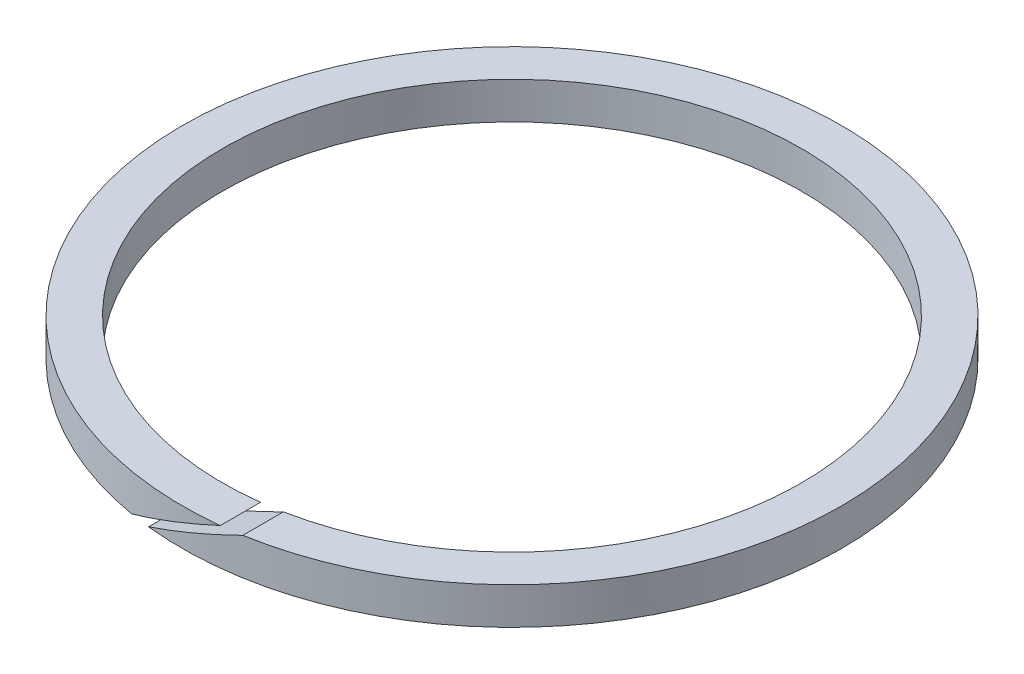
ISO-10303-21;
HEADER;
FILE_DESCRIPTION(('STEP AP214'),'2;1');
FILE_NAME('part.step','',(''),(''),'','','');
FILE_SCHEMA(('AUTOMOTIVE_DESIGN { 1 0 10303 214 1 1 1 1 }'));
ENDSEC;
DATA;
#1=APPLICATION_CONTEXT('core data for automotive mechanical design processes');
#2=APPLICATION_PROTOCOL_DEFINITION('international standard','automotive_design',2000,#1);
#3=PRODUCT_CONTEXT('',#1,'mechanical');
#4=PRODUCT('Part','Part','',(#3));
#5=PRODUCT_RELATED_PRODUCT_CATEGORY('part','',(#4));
#6=PRODUCT_DEFINITION_FORMATION('','',#4);
#7=PRODUCT_DEFINITION_CONTEXT('part definition',#1,'design');
#8=PRODUCT_DEFINITION('design','',#6,#7);
#9=PRODUCT_DEFINITION_SHAPE('','',#8);
#10=(LENGTH_UNIT() NAMED_UNIT(*) SI_UNIT(.MILLI.,.METRE.));
#11=(NAMED_UNIT(*) PLANE_ANGLE_UNIT() SI_UNIT($,.RADIAN.));
#12=(NAMED_UNIT(*) SI_UNIT($,.STERADIAN.) SOLID_ANGLE_UNIT());
#13=UNCERTAINTY_MEASURE_WITH_UNIT(LENGTH_MEASURE(1.E-05),#10,'distance_accuracy_value','');
#14=(GEOMETRIC_REPRESENTATION_CONTEXT(3) GLOBAL_UNCERTAINTY_ASSIGNED_CONTEXT((#13)) GLOBAL_UNIT_ASSIGNED_CONTEXT((#10,
#11,#12)) REPRESENTATION_CONTEXT('',''));
#15=CARTESIAN_POINT('',(0.,0.,0.));
#16=DIRECTION('',(0.,0.,1.));
#17=DIRECTION('',(1.,0.,0.));
#18=AXIS2_PLACEMENT_3D('',#15,#16,#17);
#19=CARTESIAN_POINT('',(0.,-0.6223,0.));
#20=DIRECTION('',(0.,1.,0.));
#21=DIRECTION('',(0.,0.,1.));
#22=AXIS2_PLACEMENT_3D('',#19,#20,#21);
#23=CYLINDRICAL_SURFACE('',#22,11.0998);
#24=CARTESIAN_POINT('',(0.,-0.6223,0.));
#25=DIRECTION('',(0.,1.,0.));
#26=DIRECTION('',(0.,0.,1.));
#27=AXIS2_PLACEMENT_3D('',#24,#25,#26);
#28=CIRCLE('',#27,11.0998);
#29=CARTESIAN_POINT('',(-1.20800466582949,-0.6223,11.0338698908105));
#30=VERTEX_POINT('',#29);
#31=CARTESIAN_POINT('',(-1.87248843193243,-0.6223,10.9407196798144));
#32=VERTEX_POINT('',#31);
#33=EDGE_CURVE('E77',#30,#32,#28,.T.);
#34=ORIENTED_EDGE('',*,*,#33,.T.);
#35=CARTESIAN_POINT('',(0.,0.134234434073653,0.));
#36=DIRECTION('',(0.374606593415913,-0.927183854566787,0.));
#37=DIRECTION('',(0.927183854566787,0.374606593415913,0.));
#38=AXIS2_PLACEMENT_3D('',#35,#36,#37);
#39=ELLIPSE('',#38,11.9715199367726,11.0998);
#40=CARTESIAN_POINT('',(1.20800466582948,0.6223,11.0338698908105));
#41=VERTEX_POINT('',#40);
#42=EDGE_CURVE('E89',#32,#41,#39,.F.);
#43=ORIENTED_EDGE('',*,*,#42,.T.);
#44=CARTESIAN_POINT('',(0.,0.6223,0.));
#45=DIRECTION('',(0.,1.,0.));
#46=DIRECTION('',(0.,0.,1.));
#47=AXIS2_PLACEMENT_3D('',#44,#45,#46);
#48=CIRCLE('',#47,11.0998);
#49=CARTESIAN_POINT('',(1.87248843193243,0.6223,10.9407196798145));
#50=VERTEX_POINT('',#49);
#51=EDGE_CURVE('E88',#50,#41,#48,.T.);
#52=ORIENTED_EDGE('',*,*,#51,.F.);
#53=CARTESIAN_POINT('',(0.,-0.134234434073651,0.));
#54=DIRECTION('',(-0.374606593415913,0.927183854566787,0.));
#55=DIRECTION('',(0.927183854566787,0.374606593415913,0.));
#56=AXIS2_PLACEMENT_3D('',#53,#54,#55);
#57=ELLIPSE('',#56,11.9715199367726,11.0998);
#58=EDGE_CURVE('E53',#50,#30,#57,.F.);
#59=ORIENTED_EDGE('',*,*,#58,.T.);
#60=EDGE_LOOP('',(#34,#43,#52,#59));
#61=FACE_BOUND('',#60,.T.);
#62=ADVANCED_FACE('F32',(#61),#23,.T.);
#63=CARTESIAN_POINT('',(0.,-0.6223,0.));
#64=DIRECTION('',(0.,1.,0.));
#65=DIRECTION('',(0.,0.,1.));
#66=AXIS2_PLACEMENT_3D('',#63,#64,#65);
#67=PLANE('',#66);
#68=DIRECTION('',(0.,0.,-1.));
#69=VECTOR('',#68,1.);
#70=CARTESIAN_POINT('',(-1.87248843193243,-0.6223,0.));
#71=LINE('',#70,#69);
#72=CARTESIAN_POINT('',(-1.87248843193243,-0.6223,9.57217321365839));
#73=VERTEX_POINT('',#72);
#74=EDGE_CURVE('E92',#32,#73,#71,.T.);
#75=ORIENTED_EDGE('',*,*,#74,.F.);
#76=ORIENTED_EDGE('',*,*,#33,.F.);
#77=DIRECTION('',(0.,0.,1.));
#78=VECTOR('',#77,1.);
#79=CARTESIAN_POINT('',(-1.20800466582949,-0.6223,0.));
#80=LINE('',#79,#78);
#81=CARTESIAN_POINT('',(-1.20800466582949,-0.6223,9.67850389715963));
#82=VERTEX_POINT('',#81);
#83=EDGE_CURVE('E85',#82,#30,#80,.T.);
#84=ORIENTED_EDGE('',*,*,#83,.F.);
#85=CARTESIAN_POINT('',(0.,-0.6223,0.));
#86=DIRECTION('',(0.,1.,0.));
#87=DIRECTION('',(0.,0.,1.));
#88=AXIS2_PLACEMENT_3D('',#85,#86,#87);
#89=CIRCLE('',#88,9.7536);
#90=EDGE_CURVE('E84',#82,#73,#89,.T.);
#91=ORIENTED_EDGE('',*,*,#90,.T.);
#92=EDGE_LOOP('',(#75,#76,#84,#91));
#93=FACE_BOUND('',#92,.T.);
#94=ADVANCED_FACE('F102',(#93),#67,.F.);
#95=CARTESIAN_POINT('',(0.,-0.6223,0.));
#96=DIRECTION('',(0.,1.,0.));
#97=DIRECTION('',(0.,0.,1.));
#98=AXIS2_PLACEMENT_3D('',#95,#96,#97);
#99=CYLINDRICAL_SURFACE('',#98,9.7536);
#100=CARTESIAN_POINT('',(0.,0.134234434073653,0.));
#101=DIRECTION('',(0.374606593415913,-0.927183854566787,0.));
#102=DIRECTION('',(0.927183854566787,0.374606593415913,0.));
#103=AXIS2_PLACEMENT_3D('',#100,#101,#102);
#104=ELLIPSE('',#103,10.5195964661801,9.7536);
#105=CARTESIAN_POINT('',(1.20800466582948,0.6223,9.67850389715963));
#106=VERTEX_POINT('',#105);
#107=EDGE_CURVE('E46',#73,#106,#104,.F.);
#108=ORIENTED_EDGE('',*,*,#107,.F.);
#109=ORIENTED_EDGE('',*,*,#90,.F.);
#110=CARTESIAN_POINT('',(0.,-0.134234434073651,0.));
#111=DIRECTION('',(-0.374606593415913,0.927183854566787,0.));
#112=DIRECTION('',(0.927183854566787,0.374606593415913,0.));
#113=AXIS2_PLACEMENT_3D('',#110,#111,#112);
#114=ELLIPSE('',#113,10.5195964661801,9.7536);
#115=CARTESIAN_POINT('',(1.87248843193243,0.6223,9.57217321365839));
#116=VERTEX_POINT('',#115);
#117=EDGE_CURVE('E71',#116,#82,#114,.F.);
#118=ORIENTED_EDGE('',*,*,#117,.F.);
#119=CARTESIAN_POINT('',(0.,0.6223,0.));
#120=DIRECTION('',(0.,1.,0.));
#121=DIRECTION('',(0.,0.,1.));
#122=AXIS2_PLACEMENT_3D('',#119,#120,#121);
#123=CIRCLE('',#122,9.7536);
#124=EDGE_CURVE('E82',#116,#106,#123,.T.);
#125=ORIENTED_EDGE('',*,*,#124,.T.);
#126=EDGE_LOOP('',(#108,#109,#118,#125));
#127=FACE_BOUND('',#126,.T.);
#128=ADVANCED_FACE('F81',(#127),#99,.F.);
#129=CARTESIAN_POINT('',(0.,0.6223,0.));
#130=DIRECTION('',(0.,1.,0.));
#131=DIRECTION('',(0.,0.,1.));
#132=AXIS2_PLACEMENT_3D('',#129,#130,#131);
#133=PLANE('',#132);
#134=ORIENTED_EDGE('',*,*,#51,.T.);
#135=DIRECTION('',(0.,0.,-1.));
#136=VECTOR('',#135,1.);
#137=CARTESIAN_POINT('',(1.20800466582948,0.6223,0.));
#138=LINE('',#137,#136);
#139=EDGE_CURVE('E11',#41,#106,#138,.T.);
#140=ORIENTED_EDGE('',*,*,#139,.T.);
#141=ORIENTED_EDGE('',*,*,#124,.F.);
#142=DIRECTION('',(0.,0.,1.));
#143=VECTOR('',#142,1.);
#144=CARTESIAN_POINT('',(1.87248843193243,0.6223,0.));
#145=LINE('',#144,#143);
#146=EDGE_CURVE('E39',#116,#50,#145,.T.);
#147=ORIENTED_EDGE('',*,*,#146,.T.);
#148=EDGE_LOOP('',(#134,#140,#141,#147));
#149=FACE_BOUND('',#148,.T.);
#150=ADVANCED_FACE('F87',(#149),#133,.T.);
#151=CARTESIAN_POINT('',(2.93155610010111,1.05019111287423,11.0998));
#152=DIRECTION('',(-0.374606593415913,0.927183854566787,0.));
#153=DIRECTION('',(-0.927183854566787,-0.374606593415913,0.));
#154=AXIS2_PLACEMENT_3D('',#151,#152,#153);
#155=PLANE('',#154);
#156=ORIENTED_EDGE('',*,*,#146,.F.);
#157=ORIENTED_EDGE('',*,*,#117,.T.);
#158=ORIENTED_EDGE('',*,*,#83,.T.);
#159=ORIENTED_EDGE('',*,*,#58,.F.);
#160=EDGE_LOOP('',(#156,#157,#158,#159));
#161=FACE_BOUND('',#160,.T.);
#162=ADVANCED_FACE('F70',(#161),#155,.T.);
#163=CARTESIAN_POINT('',(2.83830902686802,1.280985717953,11.0998));
#164=DIRECTION('',(0.374606593415913,-0.927183854566787,0.));
#165=DIRECTION('',(0.927183854566787,0.374606593415913,0.));
#166=AXIS2_PLACEMENT_3D('',#163,#164,#165);
#167=PLANE('',#166);
#168=ORIENTED_EDGE('',*,*,#74,.T.);
#169=ORIENTED_EDGE('',*,*,#107,.T.);
#170=ORIENTED_EDGE('',*,*,#139,.F.);
#171=ORIENTED_EDGE('',*,*,#42,.F.);
#172=EDGE_LOOP('',(#168,#169,#170,#171));
#173=FACE_BOUND('',#172,.T.);
#174=ADVANCED_FACE('F106',(#173),#167,.T.);
#175=CLOSED_SHELL('',(#62,#94,#128,#150,#162,#174));
#176=MANIFOLD_SOLID_BREP('B2',#175);
#177=ADVANCED_BREP_SHAPE_REPRESENTATION('',(#18,#176),#14);
#178=SHAPE_DEFINITION_REPRESENTATION(#9,#177);
ENDSEC;
END-ISO-10303-21;
